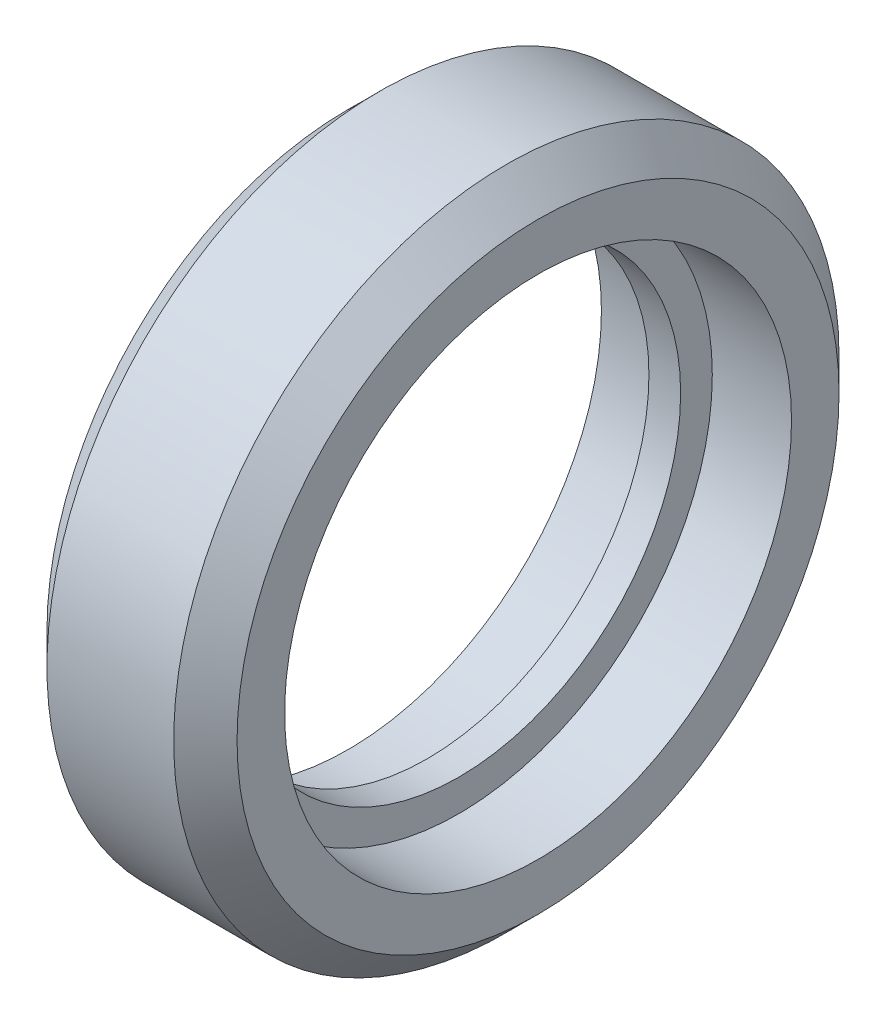
ISO-10303-21;
HEADER;
FILE_DESCRIPTION(('STEP AP214'),'2;1');
FILE_NAME('part.step','',(''),(''),'','','');
FILE_SCHEMA(('AUTOMOTIVE_DESIGN { 1 0 10303 214 1 1 1 1 }'));
ENDSEC;
DATA;
#1=APPLICATION_CONTEXT('core data for automotive mechanical design processes');
#2=APPLICATION_PROTOCOL_DEFINITION('international standard','automotive_design',2000,#1);
#3=PRODUCT_CONTEXT('',#1,'mechanical');
#4=PRODUCT('Part','Part','',(#3));
#5=PRODUCT_RELATED_PRODUCT_CATEGORY('part','',(#4));
#6=PRODUCT_DEFINITION_FORMATION('','',#4);
#7=PRODUCT_DEFINITION_CONTEXT('part definition',#1,'design');
#8=PRODUCT_DEFINITION('design','',#6,#7);
#9=PRODUCT_DEFINITION_SHAPE('','',#8);
#10=(LENGTH_UNIT() NAMED_UNIT(*) SI_UNIT(.MILLI.,.METRE.));
#11=(NAMED_UNIT(*) PLANE_ANGLE_UNIT() SI_UNIT($,.RADIAN.));
#12=(NAMED_UNIT(*) SI_UNIT($,.STERADIAN.) SOLID_ANGLE_UNIT());
#13=UNCERTAINTY_MEASURE_WITH_UNIT(LENGTH_MEASURE(1.E-05),#10,'distance_accuracy_value','');
#14=(GEOMETRIC_REPRESENTATION_CONTEXT(3) GLOBAL_UNCERTAINTY_ASSIGNED_CONTEXT((#13)) GLOBAL_UNIT_ASSIGNED_CONTEXT((#10,
#11,#12)) REPRESENTATION_CONTEXT('',''));
#15=CARTESIAN_POINT('',(0.,0.,0.));
#16=DIRECTION('',(0.,0.,1.));
#17=DIRECTION('',(1.,0.,0.));
#18=AXIS2_PLACEMENT_3D('',#15,#16,#17);
#19=CARTESIAN_POINT('',(0.,0.,0.));
#20=DIRECTION('',(1.,0.,0.));
#21=DIRECTION('',(0.,0.,-1.));
#22=AXIS2_PLACEMENT_3D('',#19,#20,#21);
#23=CYLINDRICAL_SURFACE('',#22,7.);
#24=CARTESIAN_POINT('',(-0.5,0.,0.));
#25=DIRECTION('',(1.,0.,0.));
#26=DIRECTION('',(0.,0.,-1.));
#27=AXIS2_PLACEMENT_3D('',#24,#25,#26);
#28=CIRCLE('',#27,7.);
#29=CARTESIAN_POINT('',(-0.5,0.,-7.));
#30=VERTEX_POINT('',#29);
#31=EDGE_CURVE('E10',#30,#30,#28,.T.);
#32=ORIENTED_EDGE('',*,*,#31,.F.);
#33=EDGE_LOOP('',(#32));
#34=FACE_BOUND('',#33,.T.);
#35=CARTESIAN_POINT('',(0.5,0.,0.));
#36=DIRECTION('',(1.,0.,0.));
#37=DIRECTION('',(0.,0.,-1.));
#38=AXIS2_PLACEMENT_3D('',#35,#36,#37);
#39=CIRCLE('',#38,7.);
#40=CARTESIAN_POINT('',(0.5,0.,-7.));
#41=VERTEX_POINT('',#40);
#42=EDGE_CURVE('E54',#41,#41,#39,.T.);
#43=ORIENTED_EDGE('',*,*,#42,.T.);
#44=EDGE_LOOP('',(#43));
#45=FACE_BOUND('',#44,.T.);
#46=ADVANCED_FACE('F32',(#34,#45),#23,.F.);
#47=CARTESIAN_POINT('',(-0.5,7.,0.));
#48=DIRECTION('',(-1.,0.,0.));
#49=DIRECTION('',(0.,0.,1.));
#50=AXIS2_PLACEMENT_3D('',#47,#48,#49);
#51=PLANE('',#50);
#52=ORIENTED_EDGE('',*,*,#31,.T.);
#53=EDGE_LOOP('',(#52));
#54=FACE_BOUND('',#53,.T.);
#55=CARTESIAN_POINT('',(-0.5,0.,0.));
#56=DIRECTION('',(1.,0.,0.));
#57=DIRECTION('',(0.,0.,-1.));
#58=AXIS2_PLACEMENT_3D('',#55,#56,#57);
#59=CIRCLE('',#58,8.);
#60=CARTESIAN_POINT('',(-0.5,0.,-8.));
#61=VERTEX_POINT('',#60);
#62=EDGE_CURVE('E38',#61,#61,#59,.T.);
#63=ORIENTED_EDGE('',*,*,#62,.F.);
#64=EDGE_LOOP('',(#63));
#65=FACE_BOUND('',#64,.T.);
#66=ADVANCED_FACE('F89',(#54,#65),#51,.T.);
#67=CARTESIAN_POINT('',(0.,0.,0.));
#68=DIRECTION('',(1.,0.,0.));
#69=DIRECTION('',(0.,0.,-1.));
#70=AXIS2_PLACEMENT_3D('',#67,#68,#69);
#71=CYLINDRICAL_SURFACE('',#70,8.);
#72=ORIENTED_EDGE('',*,*,#62,.T.);
#73=EDGE_LOOP('',(#72));
#74=FACE_BOUND('',#73,.T.);
#75=CARTESIAN_POINT('',(-3.,0.,0.));
#76=DIRECTION('',(1.,0.,0.));
#77=DIRECTION('',(0.,0.,-1.));
#78=AXIS2_PLACEMENT_3D('',#75,#76,#77);
#79=CIRCLE('',#78,8.);
#80=CARTESIAN_POINT('',(-3.,0.,-8.));
#81=VERTEX_POINT('',#80);
#82=EDGE_CURVE('E42',#81,#81,#79,.T.);
#83=ORIENTED_EDGE('',*,*,#82,.F.);
#84=EDGE_LOOP('',(#83));
#85=FACE_BOUND('',#84,.T.);
#86=ADVANCED_FACE('F94',(#74,#85),#71,.F.);
#87=CARTESIAN_POINT('',(-3.,8.,0.));
#88=DIRECTION('',(-1.,0.,0.));
#89=DIRECTION('',(0.,0.,1.));
#90=AXIS2_PLACEMENT_3D('',#87,#88,#89);
#91=PLANE('',#90);
#92=ORIENTED_EDGE('',*,*,#82,.T.);
#93=EDGE_LOOP('',(#92));
#94=FACE_BOUND('',#93,.T.);
#95=CARTESIAN_POINT('',(-3.,0.,0.));
#96=DIRECTION('',(1.,0.,0.));
#97=DIRECTION('',(0.,0.,-1.));
#98=AXIS2_PLACEMENT_3D('',#95,#96,#97);
#99=CIRCLE('',#98,9.5);
#100=CARTESIAN_POINT('',(-3.,0.,-9.5));
#101=VERTEX_POINT('',#100);
#102=EDGE_CURVE('E46',#101,#101,#99,.T.);
#103=ORIENTED_EDGE('',*,*,#102,.F.);
#104=EDGE_LOOP('',(#103));
#105=FACE_BOUND('',#104,.T.);
#106=ADVANCED_FACE('F85',(#94,#105),#91,.T.);
#107=CARTESIAN_POINT('',(-2.,0.,0.));
#108=DIRECTION('',(1.,0.,0.));
#109=DIRECTION('',(0.,0.,-1.));
#110=AXIS2_PLACEMENT_3D('',#107,#108,#109);
#111=CONICAL_SURFACE('',#110,10.5,0.78539816339745);
#112=ORIENTED_EDGE('',*,*,#102,.T.);
#113=EDGE_LOOP('',(#112));
#114=FACE_BOUND('',#113,.T.);
#115=CARTESIAN_POINT('',(-2.,0.,0.));
#116=DIRECTION('',(1.,0.,0.));
#117=DIRECTION('',(0.,0.,-1.));
#118=AXIS2_PLACEMENT_3D('',#115,#116,#117);
#119=CIRCLE('',#118,10.5);
#120=CARTESIAN_POINT('',(-2.,0.,-10.5));
#121=VERTEX_POINT('',#120);
#122=EDGE_CURVE('E51',#121,#121,#119,.T.);
#123=ORIENTED_EDGE('',*,*,#122,.F.);
#124=EDGE_LOOP('',(#123));
#125=FACE_BOUND('',#124,.T.);
#126=ADVANCED_FACE('F75',(#114,#125),#111,.T.);
#127=CARTESIAN_POINT('',(0.,0.,0.));
#128=DIRECTION('',(1.,0.,0.));
#129=DIRECTION('',(0.,0.,-1.));
#130=AXIS2_PLACEMENT_3D('',#127,#128,#129);
#131=CYLINDRICAL_SURFACE('',#130,10.5);
#132=ORIENTED_EDGE('',*,*,#122,.T.);
#133=EDGE_LOOP('',(#132));
#134=FACE_BOUND('',#133,.T.);
#135=CARTESIAN_POINT('',(2.,0.,0.));
#136=DIRECTION('',(1.,0.,0.));
#137=DIRECTION('',(0.,0.,-1.));
#138=AXIS2_PLACEMENT_3D('',#135,#136,#137);
#139=CIRCLE('',#138,10.5);
#140=CARTESIAN_POINT('',(2.,0.,-10.5));
#141=VERTEX_POINT('',#140);
#142=EDGE_CURVE('E66',#141,#141,#139,.T.);
#143=ORIENTED_EDGE('',*,*,#142,.F.);
#144=EDGE_LOOP('',(#143));
#145=FACE_BOUND('',#144,.T.);
#146=ADVANCED_FACE('F72',(#134,#145),#131,.T.);
#147=CARTESIAN_POINT('',(0.5,7.,0.));
#148=DIRECTION('',(1.,0.,0.));
#149=DIRECTION('',(0.,0.,1.));
#150=AXIS2_PLACEMENT_3D('',#147,#148,#149);
#151=PLANE('',#150);
#152=ORIENTED_EDGE('',*,*,#42,.F.);
#153=EDGE_LOOP('',(#152));
#154=FACE_BOUND('',#153,.T.);
#155=CARTESIAN_POINT('',(0.5,0.,0.));
#156=DIRECTION('',(1.,0.,0.));
#157=DIRECTION('',(0.,0.,-1.));
#158=AXIS2_PLACEMENT_3D('',#155,#156,#157);
#159=CIRCLE('',#158,8.);
#160=CARTESIAN_POINT('',(0.5,0.,-8.));
#161=VERTEX_POINT('',#160);
#162=EDGE_CURVE('E57',#161,#161,#159,.T.);
#163=ORIENTED_EDGE('',*,*,#162,.T.);
#164=EDGE_LOOP('',(#163));
#165=FACE_BOUND('',#164,.T.);
#166=ADVANCED_FACE('F74',(#154,#165),#151,.T.);
#167=CARTESIAN_POINT('',(0.,0.,0.));
#168=DIRECTION('',(-1.,0.,0.));
#169=DIRECTION('',(0.,0.,-1.));
#170=AXIS2_PLACEMENT_3D('',#167,#168,#169);
#171=CYLINDRICAL_SURFACE('',#170,8.);
#172=ORIENTED_EDGE('',*,*,#162,.F.);
#173=EDGE_LOOP('',(#172));
#174=FACE_BOUND('',#173,.T.);
#175=CARTESIAN_POINT('',(3.,0.,0.));
#176=DIRECTION('',(1.,0.,0.));
#177=DIRECTION('',(0.,0.,-1.));
#178=AXIS2_PLACEMENT_3D('',#175,#176,#177);
#179=CIRCLE('',#178,8.);
#180=CARTESIAN_POINT('',(3.,0.,-8.));
#181=VERTEX_POINT('',#180);
#182=EDGE_CURVE('E60',#181,#181,#179,.T.);
#183=ORIENTED_EDGE('',*,*,#182,.T.);
#184=EDGE_LOOP('',(#183));
#185=FACE_BOUND('',#184,.T.);
#186=ADVANCED_FACE('F82',(#174,#185),#171,.F.);
#187=CARTESIAN_POINT('',(3.,8.,0.));
#188=DIRECTION('',(1.,0.,0.));
#189=DIRECTION('',(0.,0.,1.));
#190=AXIS2_PLACEMENT_3D('',#187,#188,#189);
#191=PLANE('',#190);
#192=ORIENTED_EDGE('',*,*,#182,.F.);
#193=EDGE_LOOP('',(#192));
#194=FACE_BOUND('',#193,.T.);
#195=CARTESIAN_POINT('',(3.,0.,0.));
#196=DIRECTION('',(1.,0.,0.));
#197=DIRECTION('',(0.,0.,-1.));
#198=AXIS2_PLACEMENT_3D('',#195,#196,#197);
#199=CIRCLE('',#198,9.5);
#200=CARTESIAN_POINT('',(3.,0.,-9.5));
#201=VERTEX_POINT('',#200);
#202=EDGE_CURVE('E63',#201,#201,#199,.T.);
#203=ORIENTED_EDGE('',*,*,#202,.T.);
#204=EDGE_LOOP('',(#203));
#205=FACE_BOUND('',#204,.T.);
#206=ADVANCED_FACE('F102',(#194,#205),#191,.T.);
#207=CARTESIAN_POINT('',(2.,0.,0.));
#208=DIRECTION('',(-1.,0.,0.));
#209=DIRECTION('',(0.,0.,-1.));
#210=AXIS2_PLACEMENT_3D('',#207,#208,#209);
#211=CONICAL_SURFACE('',#210,10.5,0.78539816339745);
#212=ORIENTED_EDGE('',*,*,#202,.F.);
#213=EDGE_LOOP('',(#212));
#214=FACE_BOUND('',#213,.T.);
#215=ORIENTED_EDGE('',*,*,#142,.T.);
#216=EDGE_LOOP('',(#215));
#217=FACE_BOUND('',#216,.T.);
#218=ADVANCED_FACE('F70',(#214,#217),#211,.T.);
#219=CLOSED_SHELL('',(#46,#66,#86,#106,#126,#146,#166,#186,#206,#218));
#220=MANIFOLD_SOLID_BREP('B2',#219);
#221=ADVANCED_BREP_SHAPE_REPRESENTATION('',(#18,#220),#14);
#222=SHAPE_DEFINITION_REPRESENTATION(#9,#221);
ENDSEC;
END-ISO-10303-21;
